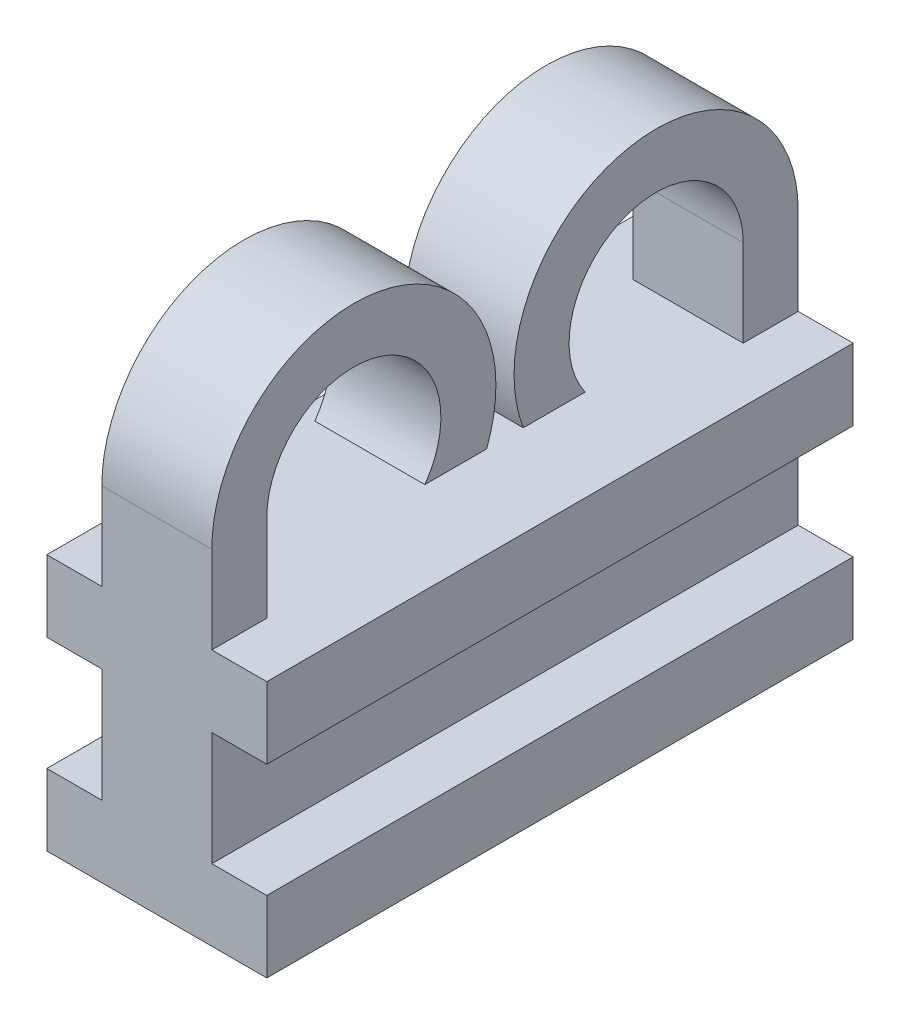
ISO-10303-21;
HEADER;
FILE_DESCRIPTION(('STEP AP214'),'2;1');
FILE_NAME('part.step','',(''),(''),'','','');
FILE_SCHEMA(('AUTOMOTIVE_DESIGN { 1 0 10303 214 1 1 1 1 }'));
ENDSEC;
DATA;
#1=APPLICATION_CONTEXT('core data for automotive mechanical design processes');
#2=APPLICATION_PROTOCOL_DEFINITION('international standard','automotive_design',2000,#1);
#3=PRODUCT_CONTEXT('',#1,'mechanical');
#4=PRODUCT('Part','Part','',(#3));
#5=PRODUCT_RELATED_PRODUCT_CATEGORY('part','',(#4));
#6=PRODUCT_DEFINITION_FORMATION('','',#4);
#7=PRODUCT_DEFINITION_CONTEXT('part definition',#1,'design');
#8=PRODUCT_DEFINITION('design','',#6,#7);
#9=PRODUCT_DEFINITION_SHAPE('','',#8);
#10=(LENGTH_UNIT() NAMED_UNIT(*) SI_UNIT(.MILLI.,.METRE.));
#11=(NAMED_UNIT(*) PLANE_ANGLE_UNIT() SI_UNIT($,.RADIAN.));
#12=(NAMED_UNIT(*) SI_UNIT($,.STERADIAN.) SOLID_ANGLE_UNIT());
#13=UNCERTAINTY_MEASURE_WITH_UNIT(LENGTH_MEASURE(1.E-05),#10,'distance_accuracy_value','');
#14=(GEOMETRIC_REPRESENTATION_CONTEXT(3) GLOBAL_UNCERTAINTY_ASSIGNED_CONTEXT((#13)) GLOBAL_UNIT_ASSIGNED_CONTEXT((#10,
#11,#12)) REPRESENTATION_CONTEXT('',''));
#15=CARTESIAN_POINT('',(0.,0.,0.));
#16=DIRECTION('',(0.,0.,1.));
#17=DIRECTION('',(1.,0.,0.));
#18=AXIS2_PLACEMENT_3D('',#15,#16,#17);
#19=CARTESIAN_POINT('',(3.,0.,0.));
#20=DIRECTION('',(1.,0.,0.));
#21=DIRECTION('',(0.,0.,-1.));
#22=AXIS2_PLACEMENT_3D('',#19,#20,#21);
#23=PLANE('',#22);
#24=DIRECTION('',(0.,-1.,0.));
#25=VECTOR('',#24,1.);
#26=CARTESIAN_POINT('',(3.,0.,7.99784418654736));
#27=LINE('',#26,#25);
#28=CARTESIAN_POINT('',(3.,-1.95,7.99784418654736));
#29=VERTEX_POINT('',#28);
#30=CARTESIAN_POINT('',(3.,-5.05,7.99784418654736));
#31=VERTEX_POINT('',#30);
#32=EDGE_CURVE('E347',#29,#31,#27,.T.);
#33=ORIENTED_EDGE('',*,*,#32,.T.);
#34=DIRECTION('',(0.,0.,-1.));
#35=VECTOR('',#34,1.);
#36=CARTESIAN_POINT('',(3.,-5.05,0.));
#37=LINE('',#36,#35);
#38=CARTESIAN_POINT('',(3.,-5.05,-7.99784418654736));
#39=VERTEX_POINT('',#38);
#40=EDGE_CURVE('E294',#31,#39,#37,.T.);
#41=ORIENTED_EDGE('',*,*,#40,.T.);
#42=DIRECTION('',(0.,-1.,0.));
#43=VECTOR('',#42,1.);
#44=CARTESIAN_POINT('',(3.,0.,-7.99784418654736));
#45=LINE('',#44,#43);
#46=CARTESIAN_POINT('',(3.,-1.95,-7.99784418654736));
#47=VERTEX_POINT('',#46);
#48=EDGE_CURVE('E291',#47,#39,#45,.T.);
#49=ORIENTED_EDGE('',*,*,#48,.F.);
#50=DIRECTION('',(0.,0.,1.));
#51=VECTOR('',#50,1.);
#52=CARTESIAN_POINT('',(3.,-1.95,0.));
#53=LINE('',#52,#51);
#54=EDGE_CURVE('E334',#47,#29,#53,.T.);
#55=ORIENTED_EDGE('',*,*,#54,.T.);
#56=EDGE_LOOP('',(#33,#41,#49,#55));
#57=FACE_BOUND('',#56,.T.);
#58=ADVANCED_FACE('F107',(#57),#23,.T.);
#59=CARTESIAN_POINT('',(0.,0.,0.));
#60=DIRECTION('',(1.,0.,0.));
#61=DIRECTION('',(0.,0.,-1.));
#62=AXIS2_PLACEMENT_3D('',#59,#60,#61);
#63=PLANE('',#62);
#64=DIRECTION('',(0.,0.,-1.));
#65=VECTOR('',#64,1.);
#66=CARTESIAN_POINT('',(0.,-5.05,0.));
#67=LINE('',#66,#65);
#68=CARTESIAN_POINT('',(0.,-5.05,7.99784418654736));
#69=VERTEX_POINT('',#68);
#70=CARTESIAN_POINT('',(0.,-5.05,-7.99784418654736));
#71=VERTEX_POINT('',#70);
#72=EDGE_CURVE('E122',#69,#71,#67,.T.);
#73=ORIENTED_EDGE('',*,*,#72,.F.);
#74=DIRECTION('',(0.,-1.,0.));
#75=VECTOR('',#74,1.);
#76=CARTESIAN_POINT('',(0.,0.,7.99784418654736));
#77=LINE('',#76,#75);
#78=CARTESIAN_POINT('',(0.,-1.95,7.99784418654736));
#79=VERTEX_POINT('',#78);
#80=EDGE_CURVE('E374',#79,#69,#77,.T.);
#81=ORIENTED_EDGE('',*,*,#80,.F.);
#82=DIRECTION('',(0.,0.,1.));
#83=VECTOR('',#82,1.);
#84=CARTESIAN_POINT('',(0.,-1.95,0.));
#85=LINE('',#84,#83);
#86=CARTESIAN_POINT('',(0.,-1.95,-7.99784418654736));
#87=VERTEX_POINT('',#86);
#88=EDGE_CURVE('E419',#87,#79,#85,.T.);
#89=ORIENTED_EDGE('',*,*,#88,.F.);
#90=DIRECTION('',(0.,-1.,0.));
#91=VECTOR('',#90,1.);
#92=CARTESIAN_POINT('',(0.,0.,-7.99784418654736));
#93=LINE('',#92,#91);
#94=EDGE_CURVE('E127',#87,#71,#93,.T.);
#95=ORIENTED_EDGE('',*,*,#94,.T.);
#96=EDGE_LOOP('',(#73,#81,#89,#95));
#97=FACE_BOUND('',#96,.T.);
#98=ADVANCED_FACE('F499',(#97),#63,.F.);
#99=CARTESIAN_POINT('',(3.,2.375,7.99784418654736));
#100=VERTEX_POINT('',#99);
#101=CARTESIAN_POINT('',(3.,0.,7.99784418654736));
#102=VERTEX_POINT('',#101);
#103=EDGE_CURVE('E348',#100,#102,#27,.T.);
#104=ORIENTED_EDGE('',*,*,#103,.T.);
#105=DIRECTION('',(0.,0.,-1.));
#106=VECTOR('',#105,1.);
#107=CARTESIAN_POINT('',(3.,0.,0.));
#108=LINE('',#107,#106);
#109=CARTESIAN_POINT('',(3.,0.,6.49784418654736));
#110=VERTEX_POINT('',#109);
#111=EDGE_CURVE('E340',#102,#110,#108,.T.);
#112=ORIENTED_EDGE('',*,*,#111,.T.);
#113=DIRECTION('',(0.,1.,0.));
#114=VECTOR('',#113,1.);
#115=CARTESIAN_POINT('',(3.,0.,6.49784418654736));
#116=LINE('',#115,#114);
#117=CARTESIAN_POINT('',(3.,2.375,6.49784418654736));
#118=VERTEX_POINT('',#117);
#119=EDGE_CURVE('E363',#110,#118,#116,.T.);
#120=ORIENTED_EDGE('',*,*,#119,.T.);
#121=CARTESIAN_POINT('',(3.,2.375,4.12284418654736));
#122=DIRECTION('',(1.,0.,0.));
#123=DIRECTION('',(0.,0.,-1.));
#124=AXIS2_PLACEMENT_3D('',#121,#122,#123);
#125=CIRCLE('',#124,2.375);
#126=CARTESIAN_POINT('',(3.,1.,2.18635251344365));
#127=VERTEX_POINT('',#126);
#128=EDGE_CURVE('E365',#118,#127,#125,.F.);
#129=ORIENTED_EDGE('',*,*,#128,.T.);
#130=DIRECTION('',(0.,0.,-1.));
#131=VECTOR('',#130,1.);
#132=CARTESIAN_POINT('',(3.,1.,0.));
#133=LINE('',#132,#131);
#134=CARTESIAN_POINT('',(3.,1.,0.499999999999999));
#135=VERTEX_POINT('',#134);
#136=EDGE_CURVE('E341',#127,#135,#133,.T.);
#137=ORIENTED_EDGE('',*,*,#136,.T.);
#138=CARTESIAN_POINT('',(3.,2.375,4.12284418654736));
#139=DIRECTION('',(1.,0.,0.));
#140=DIRECTION('',(0.,0.,-1.));
#141=AXIS2_PLACEMENT_3D('',#138,#139,#140);
#142=CIRCLE('',#141,3.875);
#143=EDGE_CURVE('E344',#135,#100,#142,.T.);
#144=ORIENTED_EDGE('',*,*,#143,.T.);
#145=EDGE_LOOP('',(#104,#112,#120,#129,#137,#144));
#146=FACE_BOUND('',#145,.T.);
#147=ADVANCED_FACE('F462',(#146),#23,.T.);
#148=DIRECTION('',(0.,-1.,0.));
#149=VECTOR('',#148,1.);
#150=CARTESIAN_POINT('',(3.,0.,-6.49784418654736));
#151=LINE('',#150,#149);
#152=CARTESIAN_POINT('',(3.,2.375,-6.49784418654736));
#153=VERTEX_POINT('',#152);
#154=CARTESIAN_POINT('',(3.,0.,-6.49784418654736));
#155=VERTEX_POINT('',#154);
#156=EDGE_CURVE('E360',#153,#155,#151,.T.);
#157=ORIENTED_EDGE('',*,*,#156,.T.);
#158=CARTESIAN_POINT('',(3.,0.,-7.99784418654736));
#159=VERTEX_POINT('',#158);
#160=EDGE_CURVE('E337',#155,#159,#108,.T.);
#161=ORIENTED_EDGE('',*,*,#160,.T.);
#162=CARTESIAN_POINT('',(3.,2.375,-7.99784418654736));
#163=VERTEX_POINT('',#162);
#164=EDGE_CURVE('E351',#163,#159,#45,.T.);
#165=ORIENTED_EDGE('',*,*,#164,.F.);
#166=CARTESIAN_POINT('',(3.,2.375,-4.12284418654736));
#167=DIRECTION('',(1.,0.,0.));
#168=DIRECTION('',(0.,0.,-1.));
#169=AXIS2_PLACEMENT_3D('',#166,#167,#168);
#170=CIRCLE('',#169,3.875);
#171=CARTESIAN_POINT('',(3.,1.,-0.500000000000001));
#172=VERTEX_POINT('',#171);
#173=EDGE_CURVE('E354',#163,#172,#170,.T.);
#174=ORIENTED_EDGE('',*,*,#173,.T.);
#175=DIRECTION('',(0.,0.,-1.));
#176=VECTOR('',#175,1.);
#177=CARTESIAN_POINT('',(3.,1.,0.));
#178=LINE('',#177,#176);
#179=CARTESIAN_POINT('',(3.,1.,-2.18635251344365));
#180=VERTEX_POINT('',#179);
#181=EDGE_CURVE('E356',#172,#180,#178,.T.);
#182=ORIENTED_EDGE('',*,*,#181,.T.);
#183=CARTESIAN_POINT('',(3.,2.375,-4.12284418654736));
#184=DIRECTION('',(1.,0.,0.));
#185=DIRECTION('',(0.,0.,-1.));
#186=AXIS2_PLACEMENT_3D('',#183,#184,#185);
#187=CIRCLE('',#186,2.375);
#188=EDGE_CURVE('E358',#180,#153,#187,.F.);
#189=ORIENTED_EDGE('',*,*,#188,.T.);
#190=EDGE_LOOP('',(#157,#161,#165,#174,#182,#189));
#191=FACE_BOUND('',#190,.T.);
#192=ADVANCED_FACE('F476',(#191),#23,.T.);
#193=DIRECTION('',(0.,0.,-1.));
#194=VECTOR('',#193,1.);
#195=CARTESIAN_POINT('',(0.,0.,0.));
#196=LINE('',#195,#194);
#197=CARTESIAN_POINT('',(0.,0.,7.99784418654736));
#198=VERTEX_POINT('',#197);
#199=CARTESIAN_POINT('',(0.,0.,6.49784418654736));
#200=VERTEX_POINT('',#199);
#201=EDGE_CURVE('E12',#198,#200,#196,.T.);
#202=ORIENTED_EDGE('',*,*,#201,.F.);
#203=CARTESIAN_POINT('',(0.,2.375,7.99784418654736));
#204=VERTEX_POINT('',#203);
#205=EDGE_CURVE('E375',#204,#198,#77,.T.);
#206=ORIENTED_EDGE('',*,*,#205,.F.);
#207=CARTESIAN_POINT('',(0.,2.375,4.12284418654736));
#208=DIRECTION('',(1.,0.,0.));
#209=DIRECTION('',(0.,0.,-1.));
#210=AXIS2_PLACEMENT_3D('',#207,#208,#209);
#211=CIRCLE('',#210,3.875);
#212=CARTESIAN_POINT('',(0.,1.,0.499999999999999));
#213=VERTEX_POINT('',#212);
#214=EDGE_CURVE('E371',#213,#204,#211,.T.);
#215=ORIENTED_EDGE('',*,*,#214,.F.);
#216=DIRECTION('',(0.,0.,-1.));
#217=VECTOR('',#216,1.);
#218=CARTESIAN_POINT('',(0.,1.,0.));
#219=LINE('',#218,#217);
#220=CARTESIAN_POINT('',(0.,1.,2.18635251344365));
#221=VERTEX_POINT('',#220);
#222=EDGE_CURVE('E368',#221,#213,#219,.T.);
#223=ORIENTED_EDGE('',*,*,#222,.F.);
#224=CARTESIAN_POINT('',(0.,2.375,4.12284418654736));
#225=DIRECTION('',(1.,0.,0.));
#226=DIRECTION('',(0.,0.,-1.));
#227=AXIS2_PLACEMENT_3D('',#224,#225,#226);
#228=CIRCLE('',#227,2.375);
#229=CARTESIAN_POINT('',(0.,2.375,6.49784418654736));
#230=VERTEX_POINT('',#229);
#231=EDGE_CURVE('E345',#230,#221,#228,.F.);
#232=ORIENTED_EDGE('',*,*,#231,.F.);
#233=DIRECTION('',(0.,1.,0.));
#234=VECTOR('',#233,1.);
#235=CARTESIAN_POINT('',(0.,0.,6.49784418654736));
#236=LINE('',#235,#234);
#237=EDGE_CURVE('E389',#200,#230,#236,.T.);
#238=ORIENTED_EDGE('',*,*,#237,.F.);
#239=EDGE_LOOP('',(#202,#206,#215,#223,#232,#238));
#240=FACE_BOUND('',#239,.T.);
#241=ADVANCED_FACE('F448',(#240),#63,.F.);
#242=CARTESIAN_POINT('',(0.,0.,-6.49784418654736));
#243=VERTEX_POINT('',#242);
#244=CARTESIAN_POINT('',(0.,0.,-7.99784418654736));
#245=VERTEX_POINT('',#244);
#246=EDGE_CURVE('E111',#243,#245,#196,.T.);
#247=ORIENTED_EDGE('',*,*,#246,.F.);
#248=DIRECTION('',(0.,-1.,0.));
#249=VECTOR('',#248,1.);
#250=CARTESIAN_POINT('',(0.,0.,-6.49784418654736));
#251=LINE('',#250,#249);
#252=CARTESIAN_POINT('',(0.,2.375,-6.49784418654736));
#253=VERTEX_POINT('',#252);
#254=EDGE_CURVE('E386',#253,#243,#251,.T.);
#255=ORIENTED_EDGE('',*,*,#254,.F.);
#256=CARTESIAN_POINT('',(0.,2.375,-4.12284418654736));
#257=DIRECTION('',(1.,0.,0.));
#258=DIRECTION('',(0.,0.,-1.));
#259=AXIS2_PLACEMENT_3D('',#256,#257,#258);
#260=CIRCLE('',#259,2.375);
#261=CARTESIAN_POINT('',(0.,1.,-2.18635251344365));
#262=VERTEX_POINT('',#261);
#263=EDGE_CURVE('E384',#262,#253,#260,.F.);
#264=ORIENTED_EDGE('',*,*,#263,.F.);
#265=DIRECTION('',(0.,0.,-1.));
#266=VECTOR('',#265,1.);
#267=CARTESIAN_POINT('',(0.,1.,0.));
#268=LINE('',#267,#266);
#269=CARTESIAN_POINT('',(0.,1.,-0.500000000000001));
#270=VERTEX_POINT('',#269);
#271=EDGE_CURVE('E382',#270,#262,#268,.T.);
#272=ORIENTED_EDGE('',*,*,#271,.F.);
#273=CARTESIAN_POINT('',(0.,2.375,-4.12284418654736));
#274=DIRECTION('',(1.,0.,0.));
#275=DIRECTION('',(0.,0.,-1.));
#276=AXIS2_PLACEMENT_3D('',#273,#274,#275);
#277=CIRCLE('',#276,3.875);
#278=CARTESIAN_POINT('',(0.,2.375,-7.99784418654736));
#279=VERTEX_POINT('',#278);
#280=EDGE_CURVE('E380',#279,#270,#277,.T.);
#281=ORIENTED_EDGE('',*,*,#280,.F.);
#282=EDGE_CURVE('E378',#279,#245,#93,.T.);
#283=ORIENTED_EDGE('',*,*,#282,.T.);
#284=EDGE_LOOP('',(#247,#255,#264,#272,#281,#283));
#285=FACE_BOUND('',#284,.T.);
#286=ADVANCED_FACE('F495',(#285),#63,.F.);
#287=CARTESIAN_POINT('',(3.,1.,0.));
#288=DIRECTION('',(0.,1.,0.));
#289=DIRECTION('',(0.,0.,1.));
#290=AXIS2_PLACEMENT_3D('',#287,#288,#289);
#291=PLANE('',#290);
#292=ORIENTED_EDGE('',*,*,#222,.T.);
#293=DIRECTION('',(-1.,0.,0.));
#294=VECTOR('',#293,1.);
#295=CARTESIAN_POINT('',(3.,1.,0.499999999999999));
#296=LINE('',#295,#294);
#297=EDGE_CURVE('E416',#135,#213,#296,.T.);
#298=ORIENTED_EDGE('',*,*,#297,.F.);
#299=ORIENTED_EDGE('',*,*,#136,.F.);
#300=DIRECTION('',(-1.,0.,0.));
#301=VECTOR('',#300,1.);
#302=CARTESIAN_POINT('',(3.,1.,2.18635251344365));
#303=LINE('',#302,#301);
#304=EDGE_CURVE('E367',#127,#221,#303,.T.);
#305=ORIENTED_EDGE('',*,*,#304,.T.);
#306=EDGE_LOOP('',(#292,#298,#299,#305));
#307=FACE_BOUND('',#306,.T.);
#308=ADVANCED_FACE('F497',(#307),#291,.F.);
#309=CARTESIAN_POINT('',(3.,2.375,4.12284418654736));
#310=DIRECTION('',(-1.,0.,0.));
#311=DIRECTION('',(0.,0.,1.));
#312=AXIS2_PLACEMENT_3D('',#309,#310,#311);
#313=CYLINDRICAL_SURFACE('',#312,3.875);
#314=ORIENTED_EDGE('',*,*,#214,.T.);
#315=DIRECTION('',(-1.,0.,0.));
#316=VECTOR('',#315,1.);
#317=CARTESIAN_POINT('',(3.,2.375,7.99784418654736));
#318=LINE('',#317,#316);
#319=EDGE_CURVE('E413',#100,#204,#318,.T.);
#320=ORIENTED_EDGE('',*,*,#319,.F.);
#321=ORIENTED_EDGE('',*,*,#143,.F.);
#322=ORIENTED_EDGE('',*,*,#297,.T.);
#323=EDGE_LOOP('',(#314,#320,#321,#322));
#324=FACE_BOUND('',#323,.T.);
#325=ADVANCED_FACE('F504',(#324),#313,.T.);
#326=CARTESIAN_POINT('',(3.,0.,7.99784418654736));
#327=DIRECTION('',(0.,0.,-1.));
#328=DIRECTION('',(-1.,0.,0.));
#329=AXIS2_PLACEMENT_3D('',#326,#327,#328);
#330=PLANE('',#329);
#331=DIRECTION('',(-1.,0.,0.));
#332=VECTOR('',#331,1.);
#333=CARTESIAN_POINT('',(3.,-7.,7.99784418654736));
#334=LINE('',#333,#332);
#335=CARTESIAN_POINT('',(4.5,-7.,7.99784418654736));
#336=VERTEX_POINT('',#335);
#337=CARTESIAN_POINT('',(-1.5,-7.,7.99784418654736));
#338=VERTEX_POINT('',#337);
#339=EDGE_CURVE('E421',#336,#338,#334,.T.);
#340=ORIENTED_EDGE('',*,*,#339,.F.);
#341=DIRECTION('',(0.,-1.,0.));
#342=VECTOR('',#341,1.);
#343=CARTESIAN_POINT('',(4.5,-7.,7.99784418654736));
#344=LINE('',#343,#342);
#345=CARTESIAN_POINT('',(4.5,-5.05,7.99784418654736));
#346=VERTEX_POINT('',#345);
#347=EDGE_CURVE('E276',#346,#336,#344,.T.);
#348=ORIENTED_EDGE('',*,*,#347,.F.);
#349=DIRECTION('',(-1.,0.,0.));
#350=VECTOR('',#349,1.);
#351=CARTESIAN_POINT('',(4.5,-5.05,7.99784418654736));
#352=LINE('',#351,#350);
#353=EDGE_CURVE('E272',#346,#31,#352,.T.);
#354=ORIENTED_EDGE('',*,*,#353,.T.);
#355=ORIENTED_EDGE('',*,*,#32,.F.);
#356=DIRECTION('',(-1.,0.,0.));
#357=VECTOR('',#356,1.);
#358=CARTESIAN_POINT('',(4.5,-1.95,7.99784418654736));
#359=LINE('',#358,#357);
#360=CARTESIAN_POINT('',(4.5,-1.95,7.99784418654736));
#361=VERTEX_POINT('',#360);
#362=EDGE_CURVE('E325',#361,#29,#359,.T.);
#363=ORIENTED_EDGE('',*,*,#362,.F.);
#364=DIRECTION('',(0.,-1.,0.));
#365=VECTOR('',#364,1.);
#366=CARTESIAN_POINT('',(4.5,0.,7.99784418654736));
#367=LINE('',#366,#365);
#368=CARTESIAN_POINT('',(4.5,0.,7.99784418654736));
#369=VERTEX_POINT('',#368);
#370=EDGE_CURVE('E307',#369,#361,#367,.T.);
#371=ORIENTED_EDGE('',*,*,#370,.F.);
#372=DIRECTION('',(-1.,0.,0.));
#373=VECTOR('',#372,1.);
#374=CARTESIAN_POINT('',(4.5,0.,7.99784418654736));
#375=LINE('',#374,#373);
#376=EDGE_CURVE('E328',#369,#102,#375,.T.);
#377=ORIENTED_EDGE('',*,*,#376,.T.);
#378=ORIENTED_EDGE('',*,*,#103,.F.);
#379=ORIENTED_EDGE('',*,*,#319,.T.);
#380=ORIENTED_EDGE('',*,*,#205,.T.);
#381=CARTESIAN_POINT('',(-1.5,0.,7.99784418654736));
#382=VERTEX_POINT('',#381);
#383=EDGE_CURVE('E327',#198,#382,#375,.T.);
#384=ORIENTED_EDGE('',*,*,#383,.T.);
#385=DIRECTION('',(0.,-1.,0.));
#386=VECTOR('',#385,1.);
#387=CARTESIAN_POINT('',(-1.5,0.,7.99784418654736));
#388=LINE('',#387,#386);
#389=CARTESIAN_POINT('',(-1.5,-1.95,7.99784418654736));
#390=VERTEX_POINT('',#389);
#391=EDGE_CURVE('E317',#382,#390,#388,.T.);
#392=ORIENTED_EDGE('',*,*,#391,.T.);
#393=EDGE_CURVE('E324',#79,#390,#359,.T.);
#394=ORIENTED_EDGE('',*,*,#393,.F.);
#395=ORIENTED_EDGE('',*,*,#80,.T.);
#396=CARTESIAN_POINT('',(-1.5,-5.05,7.99784418654736));
#397=VERTEX_POINT('',#396);
#398=EDGE_CURVE('E669',#69,#397,#352,.T.);
#399=ORIENTED_EDGE('',*,*,#398,.T.);
#400=DIRECTION('',(0.,-1.,0.));
#401=VECTOR('',#400,1.);
#402=CARTESIAN_POINT('',(-1.5,-7.,7.99784418654736));
#403=LINE('',#402,#401);
#404=EDGE_CURVE('E682',#397,#338,#403,.T.);
#405=ORIENTED_EDGE('',*,*,#404,.T.);
#406=EDGE_LOOP('',(#340,#348,#354,#355,#363,#371,#377,#378,#379,#380,#384,#392,#394,#395,#399,#405));
#407=FACE_BOUND('',#406,.T.);
#408=ADVANCED_FACE('F443',(#407),#330,.F.);
#409=CARTESIAN_POINT('',(3.,0.,-7.99784418654736));
#410=DIRECTION('',(0.,0.,-1.));
#411=DIRECTION('',(0.,1.,0.));
#412=AXIS2_PLACEMENT_3D('',#409,#410,#411);
#413=PLANE('',#412);
#414=DIRECTION('',(-1.,0.,0.));
#415=VECTOR('',#414,1.);
#416=CARTESIAN_POINT('',(3.,-7.,-7.99784418654736));
#417=LINE('',#416,#415);
#418=CARTESIAN_POINT('',(4.5,-7.,-7.99784418654736));
#419=VERTEX_POINT('',#418);
#420=CARTESIAN_POINT('',(-1.5,-7.,-7.99784418654736));
#421=VERTEX_POINT('',#420);
#422=EDGE_CURVE('E372',#419,#421,#417,.T.);
#423=ORIENTED_EDGE('',*,*,#422,.T.);
#424=DIRECTION('',(0.,1.,0.));
#425=VECTOR('',#424,1.);
#426=CARTESIAN_POINT('',(-1.5,-7.,-7.99784418654736));
#427=LINE('',#426,#425);
#428=CARTESIAN_POINT('',(-1.5,-5.05,-7.99784418654736));
#429=VERTEX_POINT('',#428);
#430=EDGE_CURVE('E678',#421,#429,#427,.T.);
#431=ORIENTED_EDGE('',*,*,#430,.T.);
#432=DIRECTION('',(-1.,0.,0.));
#433=VECTOR('',#432,1.);
#434=CARTESIAN_POINT('',(4.5,-5.05,-7.99784418654736));
#435=LINE('',#434,#433);
#436=EDGE_CURVE('E292',#71,#429,#435,.T.);
#437=ORIENTED_EDGE('',*,*,#436,.F.);
#438=ORIENTED_EDGE('',*,*,#94,.F.);
#439=DIRECTION('',(-1.,0.,0.));
#440=VECTOR('',#439,1.);
#441=CARTESIAN_POINT('',(4.5,-1.95,-7.99784418654736));
#442=LINE('',#441,#440);
#443=CARTESIAN_POINT('',(-1.5,-1.95,-7.99784418654736));
#444=VERTEX_POINT('',#443);
#445=EDGE_CURVE('E311',#87,#444,#442,.T.);
#446=ORIENTED_EDGE('',*,*,#445,.T.);
#447=DIRECTION('',(0.,1.,0.));
#448=VECTOR('',#447,1.);
#449=CARTESIAN_POINT('',(-1.5,0.,-7.99784418654736));
#450=LINE('',#449,#448);
#451=CARTESIAN_POINT('',(-1.5,0.,-7.99784418654736));
#452=VERTEX_POINT('',#451);
#453=EDGE_CURVE('E300',#444,#452,#450,.T.);
#454=ORIENTED_EDGE('',*,*,#453,.T.);
#455=DIRECTION('',(-1.,0.,0.));
#456=VECTOR('',#455,1.);
#457=CARTESIAN_POINT('',(4.5,0.,-7.99784418654736));
#458=LINE('',#457,#456);
#459=EDGE_CURVE('E331',#245,#452,#458,.T.);
#460=ORIENTED_EDGE('',*,*,#459,.F.);
#461=ORIENTED_EDGE('',*,*,#282,.F.);
#462=DIRECTION('',(-1.,0.,0.));
#463=VECTOR('',#462,1.);
#464=CARTESIAN_POINT('',(3.,2.375,-7.99784418654736));
#465=LINE('',#464,#463);
#466=EDGE_CURVE('E411',#163,#279,#465,.T.);
#467=ORIENTED_EDGE('',*,*,#466,.F.);
#468=ORIENTED_EDGE('',*,*,#164,.T.);
#469=CARTESIAN_POINT('',(4.5,0.,-7.99784418654736));
#470=VERTEX_POINT('',#469);
#471=EDGE_CURVE('E332',#470,#159,#458,.T.);
#472=ORIENTED_EDGE('',*,*,#471,.F.);
#473=DIRECTION('',(0.,1.,0.));
#474=VECTOR('',#473,1.);
#475=CARTESIAN_POINT('',(4.5,0.,-7.99784418654736));
#476=LINE('',#475,#474);
#477=CARTESIAN_POINT('',(4.5,-1.95,-7.99784418654736));
#478=VERTEX_POINT('',#477);
#479=EDGE_CURVE('E301',#478,#470,#476,.T.);
#480=ORIENTED_EDGE('',*,*,#479,.F.);
#481=EDGE_CURVE('E322',#478,#47,#442,.T.);
#482=ORIENTED_EDGE('',*,*,#481,.T.);
#483=ORIENTED_EDGE('',*,*,#48,.T.);
#484=CARTESIAN_POINT('',(4.5,-5.05,-7.99784418654736));
#485=VERTEX_POINT('',#484);
#486=EDGE_CURVE('E269',#485,#39,#435,.T.);
#487=ORIENTED_EDGE('',*,*,#486,.F.);
#488=DIRECTION('',(0.,1.,0.));
#489=VECTOR('',#488,1.);
#490=CARTESIAN_POINT('',(4.5,-7.,-7.99784418654736));
#491=LINE('',#490,#489);
#492=EDGE_CURVE('E277',#419,#485,#491,.T.);
#493=ORIENTED_EDGE('',*,*,#492,.F.);
#494=EDGE_LOOP('',(#423,#431,#437,#438,#446,#454,#460,#461,#467,#468,#472,#480,#482,#483,#487,#493));
#495=FACE_BOUND('',#494,.T.);
#496=ADVANCED_FACE('F288',(#495),#413,.T.);
#497=CARTESIAN_POINT('',(3.,2.375,-4.12284418654736));
#498=DIRECTION('',(-1.,0.,0.));
#499=DIRECTION('',(0.,0.,1.));
#500=AXIS2_PLACEMENT_3D('',#497,#498,#499);
#501=CYLINDRICAL_SURFACE('',#500,3.875);
#502=ORIENTED_EDGE('',*,*,#280,.T.);
#503=DIRECTION('',(-1.,0.,0.));
#504=VECTOR('',#503,1.);
#505=CARTESIAN_POINT('',(3.,1.,-0.500000000000001));
#506=LINE('',#505,#504);
#507=EDGE_CURVE('E408',#172,#270,#506,.T.);
#508=ORIENTED_EDGE('',*,*,#507,.F.);
#509=ORIENTED_EDGE('',*,*,#173,.F.);
#510=ORIENTED_EDGE('',*,*,#466,.T.);
#511=EDGE_LOOP('',(#502,#508,#509,#510));
#512=FACE_BOUND('',#511,.T.);
#513=ADVANCED_FACE('F482',(#512),#501,.T.);
#514=CARTESIAN_POINT('',(3.,1.,0.));
#515=DIRECTION('',(0.,1.,0.));
#516=DIRECTION('',(0.,0.,1.));
#517=AXIS2_PLACEMENT_3D('',#514,#515,#516);
#518=PLANE('',#517);
#519=ORIENTED_EDGE('',*,*,#271,.T.);
#520=DIRECTION('',(-1.,0.,0.));
#521=VECTOR('',#520,1.);
#522=CARTESIAN_POINT('',(3.,1.,-2.18635251344365));
#523=LINE('',#522,#521);
#524=EDGE_CURVE('E405',#180,#262,#523,.T.);
#525=ORIENTED_EDGE('',*,*,#524,.F.);
#526=ORIENTED_EDGE('',*,*,#181,.F.);
#527=ORIENTED_EDGE('',*,*,#507,.T.);
#528=EDGE_LOOP('',(#519,#525,#526,#527));
#529=FACE_BOUND('',#528,.T.);
#530=ADVANCED_FACE('F488',(#529),#518,.F.);
#531=CARTESIAN_POINT('',(3.,2.375,-4.12284418654736));
#532=DIRECTION('',(-1.,0.,0.));
#533=DIRECTION('',(0.,0.,1.));
#534=AXIS2_PLACEMENT_3D('',#531,#532,#533);
#535=CYLINDRICAL_SURFACE('',#534,2.375);
#536=ORIENTED_EDGE('',*,*,#263,.T.);
#537=DIRECTION('',(-1.,0.,0.));
#538=VECTOR('',#537,1.);
#539=CARTESIAN_POINT('',(3.,2.375,-6.49784418654736));
#540=LINE('',#539,#538);
#541=EDGE_CURVE('E402',#153,#253,#540,.T.);
#542=ORIENTED_EDGE('',*,*,#541,.F.);
#543=ORIENTED_EDGE('',*,*,#188,.F.);
#544=ORIENTED_EDGE('',*,*,#524,.T.);
#545=EDGE_LOOP('',(#536,#542,#543,#544));
#546=FACE_BOUND('',#545,.T.);
#547=ADVANCED_FACE('F492',(#546),#535,.F.);
#548=CARTESIAN_POINT('',(3.,0.,-6.49784418654736));
#549=DIRECTION('',(0.,0.,-1.));
#550=DIRECTION('',(0.,1.,0.));
#551=AXIS2_PLACEMENT_3D('',#548,#549,#550);
#552=PLANE('',#551);
#553=ORIENTED_EDGE('',*,*,#254,.T.);
#554=DIRECTION('',(-1.,0.,0.));
#555=VECTOR('',#554,1.);
#556=CARTESIAN_POINT('',(3.,0.,-6.49784418654736));
#557=LINE('',#556,#555);
#558=EDGE_CURVE('E399',#155,#243,#557,.T.);
#559=ORIENTED_EDGE('',*,*,#558,.F.);
#560=ORIENTED_EDGE('',*,*,#156,.F.);
#561=ORIENTED_EDGE('',*,*,#541,.T.);
#562=EDGE_LOOP('',(#553,#559,#560,#561));
#563=FACE_BOUND('',#562,.T.);
#564=ADVANCED_FACE('F494',(#563),#552,.F.);
#565=CARTESIAN_POINT('',(3.,0.,0.));
#566=DIRECTION('',(0.,1.,0.));
#567=DIRECTION('',(0.,0.,1.));
#568=AXIS2_PLACEMENT_3D('',#565,#566,#567);
#569=PLANE('',#568);
#570=ORIENTED_EDGE('',*,*,#558,.T.);
#571=ORIENTED_EDGE('',*,*,#246,.T.);
#572=ORIENTED_EDGE('',*,*,#459,.T.);
#573=DIRECTION('',(0.,0.,1.));
#574=VECTOR('',#573,1.);
#575=CARTESIAN_POINT('',(-1.5,0.,-7.99784418654736));
#576=LINE('',#575,#574);
#577=EDGE_CURVE('E314',#452,#382,#576,.T.);
#578=ORIENTED_EDGE('',*,*,#577,.T.);
#579=ORIENTED_EDGE('',*,*,#383,.F.);
#580=ORIENTED_EDGE('',*,*,#201,.T.);
#581=DIRECTION('',(-1.,0.,0.));
#582=VECTOR('',#581,1.);
#583=CARTESIAN_POINT('',(3.,0.,6.49784418654736));
#584=LINE('',#583,#582);
#585=EDGE_CURVE('E397',#110,#200,#584,.T.);
#586=ORIENTED_EDGE('',*,*,#585,.F.);
#587=ORIENTED_EDGE('',*,*,#111,.F.);
#588=ORIENTED_EDGE('',*,*,#376,.F.);
#589=DIRECTION('',(0.,0.,1.));
#590=VECTOR('',#589,1.);
#591=CARTESIAN_POINT('',(4.5,0.,-7.99784418654736));
#592=LINE('',#591,#590);
#593=EDGE_CURVE('E304',#470,#369,#592,.T.);
#594=ORIENTED_EDGE('',*,*,#593,.F.);
#595=ORIENTED_EDGE('',*,*,#471,.T.);
#596=ORIENTED_EDGE('',*,*,#160,.F.);
#597=EDGE_LOOP('',(#570,#571,#572,#578,#579,#580,#586,#587,#588,#594,#595,#596));
#598=FACE_BOUND('',#597,.T.);
#599=ADVANCED_FACE('F429',(#598),#569,.T.);
#600=CARTESIAN_POINT('',(3.,0.,6.49784418654736));
#601=DIRECTION('',(0.,0.,1.));
#602=DIRECTION('',(1.,0.,0.));
#603=AXIS2_PLACEMENT_3D('',#600,#601,#602);
#604=PLANE('',#603);
#605=ORIENTED_EDGE('',*,*,#237,.T.);
#606=DIRECTION('',(-1.,0.,0.));
#607=VECTOR('',#606,1.);
#608=CARTESIAN_POINT('',(3.,2.375,6.49784418654736));
#609=LINE('',#608,#607);
#610=EDGE_CURVE('E394',#118,#230,#609,.T.);
#611=ORIENTED_EDGE('',*,*,#610,.F.);
#612=ORIENTED_EDGE('',*,*,#119,.F.);
#613=ORIENTED_EDGE('',*,*,#585,.T.);
#614=EDGE_LOOP('',(#605,#611,#612,#613));
#615=FACE_BOUND('',#614,.T.);
#616=ADVANCED_FACE('F454',(#615),#604,.F.);
#617=CARTESIAN_POINT('',(3.,2.375,4.12284418654736));
#618=DIRECTION('',(-1.,0.,0.));
#619=DIRECTION('',(0.,0.,1.));
#620=AXIS2_PLACEMENT_3D('',#617,#618,#619);
#621=CYLINDRICAL_SURFACE('',#620,2.375);
#622=ORIENTED_EDGE('',*,*,#231,.T.);
#623=ORIENTED_EDGE('',*,*,#304,.F.);
#624=ORIENTED_EDGE('',*,*,#128,.F.);
#625=ORIENTED_EDGE('',*,*,#610,.T.);
#626=EDGE_LOOP('',(#622,#623,#624,#625));
#627=FACE_BOUND('',#626,.T.);
#628=ADVANCED_FACE('F458',(#627),#621,.F.);
#629=CARTESIAN_POINT('',(3.,-7.,-7.99784418654736));
#630=DIRECTION('',(0.,-1.,0.));
#631=DIRECTION('',(0.,0.,-1.));
#632=AXIS2_PLACEMENT_3D('',#629,#630,#631);
#633=PLANE('',#632);
#634=ORIENTED_EDGE('',*,*,#339,.T.);
#635=DIRECTION('',(0.,0.,-1.));
#636=VECTOR('',#635,1.);
#637=CARTESIAN_POINT('',(-1.5,-7.,-7.99784418654736));
#638=LINE('',#637,#636);
#639=EDGE_CURVE('E285',#338,#421,#638,.T.);
#640=ORIENTED_EDGE('',*,*,#639,.T.);
#641=ORIENTED_EDGE('',*,*,#422,.F.);
#642=DIRECTION('',(0.,0.,-1.));
#643=VECTOR('',#642,1.);
#644=CARTESIAN_POINT('',(4.5,-7.,-7.99784418654736));
#645=LINE('',#644,#643);
#646=EDGE_CURVE('E283',#336,#419,#645,.T.);
#647=ORIENTED_EDGE('',*,*,#646,.F.);
#648=EDGE_LOOP('',(#634,#640,#641,#647));
#649=FACE_BOUND('',#648,.T.);
#650=ADVANCED_FACE('F109',(#649),#633,.T.);
#651=CARTESIAN_POINT('',(-1.5,0.,0.));
#652=DIRECTION('',(-1.,0.,0.));
#653=DIRECTION('',(0.,0.,1.));
#654=AXIS2_PLACEMENT_3D('',#651,#652,#653);
#655=PLANE('',#654);
#656=ORIENTED_EDGE('',*,*,#453,.F.);
#657=DIRECTION('',(0.,0.,-1.));
#658=VECTOR('',#657,1.);
#659=CARTESIAN_POINT('',(-1.5,-1.95,-7.99784418654736));
#660=LINE('',#659,#658);
#661=EDGE_CURVE('E305',#390,#444,#660,.T.);
#662=ORIENTED_EDGE('',*,*,#661,.F.);
#663=ORIENTED_EDGE('',*,*,#391,.F.);
#664=ORIENTED_EDGE('',*,*,#577,.F.);
#665=EDGE_LOOP('',(#656,#662,#663,#664));
#666=FACE_BOUND('',#665,.T.);
#667=ADVANCED_FACE('F438',(#666),#655,.T.);
#668=CARTESIAN_POINT('',(4.5,-1.95,-7.99784418654736));
#669=DIRECTION('',(0.,1.,0.));
#670=DIRECTION('',(0.,0.,1.));
#671=AXIS2_PLACEMENT_3D('',#668,#669,#670);
#672=PLANE('',#671);
#673=ORIENTED_EDGE('',*,*,#445,.F.);
#674=ORIENTED_EDGE('',*,*,#88,.T.);
#675=ORIENTED_EDGE('',*,*,#393,.T.);
#676=ORIENTED_EDGE('',*,*,#661,.T.);
#677=EDGE_LOOP('',(#673,#674,#675,#676));
#678=FACE_BOUND('',#677,.T.);
#679=ADVANCED_FACE('F604',(#678),#672,.F.);
#680=ORIENTED_EDGE('',*,*,#54,.F.);
#681=ORIENTED_EDGE('',*,*,#481,.F.);
#682=DIRECTION('',(0.,0.,-1.));
#683=VECTOR('',#682,1.);
#684=CARTESIAN_POINT('',(4.5,-1.95,-7.99784418654736));
#685=LINE('',#684,#683);
#686=EDGE_CURVE('E309',#361,#478,#685,.T.);
#687=ORIENTED_EDGE('',*,*,#686,.F.);
#688=ORIENTED_EDGE('',*,*,#362,.T.);
#689=EDGE_LOOP('',(#680,#681,#687,#688));
#690=FACE_BOUND('',#689,.T.);
#691=ADVANCED_FACE('F613',(#690),#672,.F.);
#692=CARTESIAN_POINT('',(4.5,0.,0.));
#693=DIRECTION('',(-1.,0.,0.));
#694=DIRECTION('',(0.,0.,1.));
#695=AXIS2_PLACEMENT_3D('',#692,#693,#694);
#696=PLANE('',#695);
#697=ORIENTED_EDGE('',*,*,#479,.T.);
#698=ORIENTED_EDGE('',*,*,#593,.T.);
#699=ORIENTED_EDGE('',*,*,#370,.T.);
#700=ORIENTED_EDGE('',*,*,#686,.T.);
#701=EDGE_LOOP('',(#697,#698,#699,#700));
#702=FACE_BOUND('',#701,.T.);
#703=ADVANCED_FACE('F470',(#702),#696,.F.);
#704=CARTESIAN_POINT('',(-1.5,0.,0.));
#705=DIRECTION('',(1.,0.,0.));
#706=DIRECTION('',(0.,0.,-1.));
#707=AXIS2_PLACEMENT_3D('',#704,#705,#706);
#708=PLANE('',#707);
#709=ORIENTED_EDGE('',*,*,#430,.F.);
#710=ORIENTED_EDGE('',*,*,#639,.F.);
#711=ORIENTED_EDGE('',*,*,#404,.F.);
#712=DIRECTION('',(0.,0.,1.));
#713=VECTOR('',#712,1.);
#714=CARTESIAN_POINT('',(-1.5,-5.05,-7.99784418654736));
#715=LINE('',#714,#713);
#716=EDGE_CURVE('E672',#429,#397,#715,.T.);
#717=ORIENTED_EDGE('',*,*,#716,.F.);
#718=EDGE_LOOP('',(#709,#710,#711,#717));
#719=FACE_BOUND('',#718,.T.);
#720=ADVANCED_FACE('F629',(#719),#708,.F.);
#721=CARTESIAN_POINT('',(4.5,-5.05,-7.99784418654736));
#722=DIRECTION('',(0.,-1.,0.));
#723=DIRECTION('',(0.,0.,-1.));
#724=AXIS2_PLACEMENT_3D('',#721,#722,#723);
#725=PLANE('',#724);
#726=ORIENTED_EDGE('',*,*,#398,.F.);
#727=ORIENTED_EDGE('',*,*,#72,.T.);
#728=ORIENTED_EDGE('',*,*,#436,.T.);
#729=ORIENTED_EDGE('',*,*,#716,.T.);
#730=EDGE_LOOP('',(#726,#727,#728,#729));
#731=FACE_BOUND('',#730,.T.);
#732=ADVANCED_FACE('F638',(#731),#725,.F.);
#733=ORIENTED_EDGE('',*,*,#40,.F.);
#734=ORIENTED_EDGE('',*,*,#353,.F.);
#735=DIRECTION('',(0.,0.,1.));
#736=VECTOR('',#735,1.);
#737=CARTESIAN_POINT('',(4.5,-5.05,-7.99784418654736));
#738=LINE('',#737,#736);
#739=EDGE_CURVE('E265',#485,#346,#738,.T.);
#740=ORIENTED_EDGE('',*,*,#739,.F.);
#741=ORIENTED_EDGE('',*,*,#486,.T.);
#742=EDGE_LOOP('',(#733,#734,#740,#741));
#743=FACE_BOUND('',#742,.T.);
#744=ADVANCED_FACE('F267',(#743),#725,.F.);
#745=CARTESIAN_POINT('',(4.5,0.,0.));
#746=DIRECTION('',(1.,0.,0.));
#747=DIRECTION('',(0.,0.,-1.));
#748=AXIS2_PLACEMENT_3D('',#745,#746,#747);
#749=PLANE('',#748);
#750=ORIENTED_EDGE('',*,*,#492,.T.);
#751=ORIENTED_EDGE('',*,*,#739,.T.);
#752=ORIENTED_EDGE('',*,*,#347,.T.);
#753=ORIENTED_EDGE('',*,*,#646,.T.);
#754=EDGE_LOOP('',(#750,#751,#752,#753));
#755=FACE_BOUND('',#754,.T.);
#756=ADVANCED_FACE('F281',(#755),#749,.T.);
#757=CLOSED_SHELL('',(#58,#98,#147,#192,#241,#286,#308,#325,#408,#496,#513,#530,#547,#564,#599,
#616,#628,#650,#667,#679,#691,#703,#720,#732,#744,#756));
#758=MANIFOLD_SOLID_BREP('B2',#757);
#759=ADVANCED_BREP_SHAPE_REPRESENTATION('',(#18,#758),#14);
#760=SHAPE_DEFINITION_REPRESENTATION(#9,#759);
ENDSEC;
END-ISO-10303-21;
